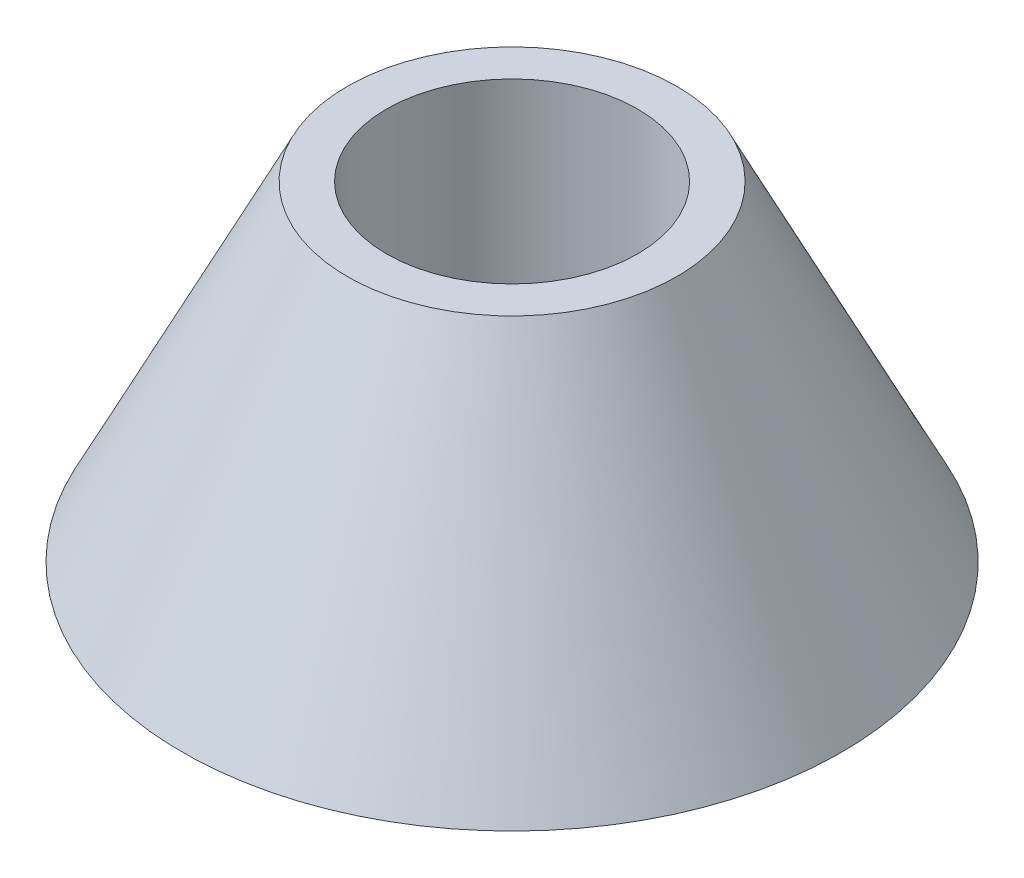
ISO-10303-21;
HEADER;
FILE_DESCRIPTION(('STEP AP214'),'2;1');
FILE_NAME('part.step','',(''),(''),'','','');
FILE_SCHEMA(('AUTOMOTIVE_DESIGN { 1 0 10303 214 1 1 1 1 }'));
ENDSEC;
DATA;
#1=APPLICATION_CONTEXT('core data for automotive mechanical design processes');
#2=APPLICATION_PROTOCOL_DEFINITION('international standard','automotive_design',2000,#1);
#3=PRODUCT_CONTEXT('',#1,'mechanical');
#4=PRODUCT('Part','Part','',(#3));
#5=PRODUCT_RELATED_PRODUCT_CATEGORY('part','',(#4));
#6=PRODUCT_DEFINITION_FORMATION('','',#4);
#7=PRODUCT_DEFINITION_CONTEXT('part definition',#1,'design');
#8=PRODUCT_DEFINITION('design','',#6,#7);
#9=PRODUCT_DEFINITION_SHAPE('','',#8);
#10=(LENGTH_UNIT() NAMED_UNIT(*) SI_UNIT(.MILLI.,.METRE.));
#11=(NAMED_UNIT(*) PLANE_ANGLE_UNIT() SI_UNIT($,.RADIAN.));
#12=(NAMED_UNIT(*) SI_UNIT($,.STERADIAN.) SOLID_ANGLE_UNIT());
#13=UNCERTAINTY_MEASURE_WITH_UNIT(LENGTH_MEASURE(1.E-05),#10,'distance_accuracy_value','');
#14=(GEOMETRIC_REPRESENTATION_CONTEXT(3) GLOBAL_UNCERTAINTY_ASSIGNED_CONTEXT((#13)) GLOBAL_UNIT_ASSIGNED_CONTEXT((#10,
#11,#12)) REPRESENTATION_CONTEXT('',''));
#15=CARTESIAN_POINT('',(0.,0.,0.));
#16=DIRECTION('',(0.,0.,1.));
#17=DIRECTION('',(1.,0.,0.));
#18=AXIS2_PLACEMENT_3D('',#15,#16,#17);
#19=CARTESIAN_POINT('',(0.,10.,0.));
#20=DIRECTION('',(0.,1.,0.));
#21=DIRECTION('',(0.,0.,1.));
#22=AXIS2_PLACEMENT_3D('',#19,#20,#21);
#23=PLANE('',#22);
#24=CARTESIAN_POINT('',(0.,10.,0.));
#25=DIRECTION('',(0.,-1.,0.));
#26=DIRECTION('',(0.,0.,-1.));
#27=AXIS2_PLACEMENT_3D('',#24,#25,#26);
#28=CIRCLE('',#27,19.05);
#29=CARTESIAN_POINT('',(0.,10.,-19.05));
#30=VERTEX_POINT('',#29);
#31=EDGE_CURVE('E10',#30,#30,#28,.T.);
#32=ORIENTED_EDGE('',*,*,#31,.F.);
#33=EDGE_LOOP('',(#32));
#34=FACE_BOUND('',#33,.T.);
#35=ADVANCED_FACE('F33',(#34),#23,.T.);
#36=CARTESIAN_POINT('',(0.,0.,0.));
#37=DIRECTION('',(0.,-1.,0.));
#38=DIRECTION('',(0.,0.,-1.));
#39=AXIS2_PLACEMENT_3D('',#36,#37,#38);
#40=CYLINDRICAL_SURFACE('',#39,19.05);
#41=ORIENTED_EDGE('',*,*,#31,.T.);
#42=EDGE_LOOP('',(#41));
#43=FACE_BOUND('',#42,.T.);
#44=CARTESIAN_POINT('',(0.,50.,0.));
#45=DIRECTION('',(0.,-1.,0.));
#46=DIRECTION('',(0.,0.,-1.));
#47=AXIS2_PLACEMENT_3D('',#44,#45,#46);
#48=CIRCLE('',#47,19.05);
#49=CARTESIAN_POINT('',(0.,50.,-19.05));
#50=VERTEX_POINT('',#49);
#51=EDGE_CURVE('E39',#50,#50,#48,.T.);
#52=ORIENTED_EDGE('',*,*,#51,.F.);
#53=EDGE_LOOP('',(#52));
#54=FACE_BOUND('',#53,.T.);
#55=ADVANCED_FACE('F65',(#43,#54),#40,.F.);
#56=CARTESIAN_POINT('',(19.05,50.,0.));
#57=DIRECTION('',(0.,1.,0.));
#58=DIRECTION('',(0.,0.,1.));
#59=AXIS2_PLACEMENT_3D('',#56,#57,#58);
#60=PLANE('',#59);
#61=ORIENTED_EDGE('',*,*,#51,.T.);
#62=EDGE_LOOP('',(#61));
#63=FACE_BOUND('',#62,.T.);
#64=CARTESIAN_POINT('',(0.,50.,0.));
#65=DIRECTION('',(0.,-1.,0.));
#66=DIRECTION('',(0.,0.,-1.));
#67=AXIS2_PLACEMENT_3D('',#64,#65,#66);
#68=CIRCLE('',#67,25.);
#69=CARTESIAN_POINT('',(0.,50.,-25.));
#70=VERTEX_POINT('',#69);
#71=EDGE_CURVE('E43',#70,#70,#68,.T.);
#72=ORIENTED_EDGE('',*,*,#71,.F.);
#73=EDGE_LOOP('',(#72));
#74=FACE_BOUND('',#73,.T.);
#75=ADVANCED_FACE('F57',(#63,#74),#60,.T.);
#76=CARTESIAN_POINT('',(0.,0.,0.));
#77=DIRECTION('',(0.,-1.,0.));
#78=DIRECTION('',(0.,0.,-1.));
#79=AXIS2_PLACEMENT_3D('',#76,#77,#78);
#80=CONICAL_SURFACE('',#79,50.,0.463647609000806);
#81=ORIENTED_EDGE('',*,*,#71,.T.);
#82=EDGE_LOOP('',(#81));
#83=FACE_BOUND('',#82,.T.);
#84=CARTESIAN_POINT('',(0.,0.,0.));
#85=DIRECTION('',(0.,-1.,0.));
#86=DIRECTION('',(0.,0.,-1.));
#87=AXIS2_PLACEMENT_3D('',#84,#85,#86);
#88=CIRCLE('',#87,50.);
#89=CARTESIAN_POINT('',(0.,0.,-50.));
#90=VERTEX_POINT('',#89);
#91=EDGE_CURVE('E47',#90,#90,#88,.T.);
#92=ORIENTED_EDGE('',*,*,#91,.F.);
#93=EDGE_LOOP('',(#92));
#94=FACE_BOUND('',#93,.T.);
#95=ADVANCED_FACE('F55',(#83,#94),#80,.T.);
#96=CARTESIAN_POINT('',(50.,0.,0.));
#97=DIRECTION('',(0.,-1.,0.));
#98=DIRECTION('',(0.,0.,-1.));
#99=AXIS2_PLACEMENT_3D('',#96,#97,#98);
#100=PLANE('',#99);
#101=ORIENTED_EDGE('',*,*,#91,.T.);
#102=EDGE_LOOP('',(#101));
#103=FACE_BOUND('',#102,.T.);
#104=ADVANCED_FACE('F53',(#103),#100,.T.);
#105=CLOSED_SHELL('',(#35,#55,#75,#95,#104));
#106=MANIFOLD_SOLID_BREP('B2',#105);
#107=ADVANCED_BREP_SHAPE_REPRESENTATION('',(#18,#106),#14);
#108=SHAPE_DEFINITION_REPRESENTATION(#9,#107);
ENDSEC;
END-ISO-10303-21;
